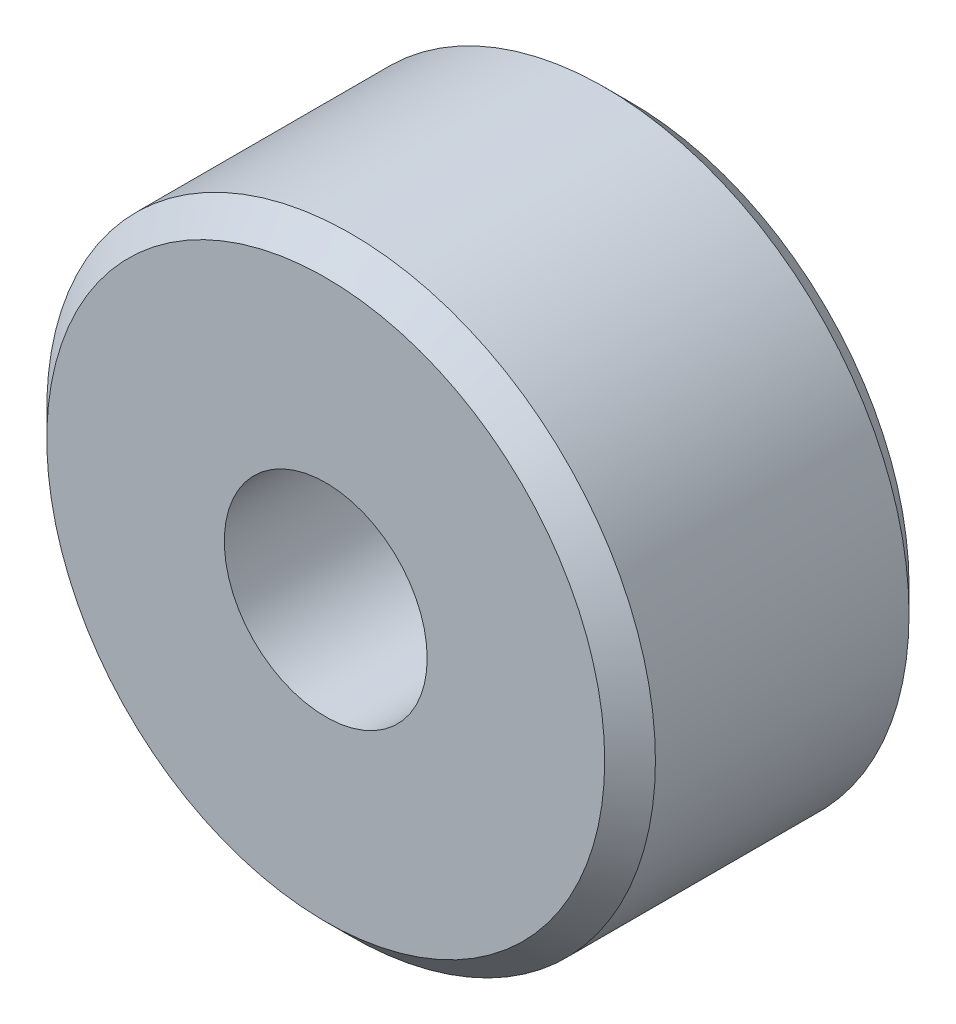
ISO-10303-21;
HEADER;
FILE_DESCRIPTION(('STEP AP214'),'2;1');
FILE_NAME('part.step','',(''),(''),'','','');
FILE_SCHEMA(('AUTOMOTIVE_DESIGN { 1 0 10303 214 1 1 1 1 }'));
ENDSEC;
DATA;
#1=APPLICATION_CONTEXT('core data for automotive mechanical design processes');
#2=APPLICATION_PROTOCOL_DEFINITION('international standard','automotive_design',2000,#1);
#3=PRODUCT_CONTEXT('',#1,'mechanical');
#4=PRODUCT('Part','Part','',(#3));
#5=PRODUCT_RELATED_PRODUCT_CATEGORY('part','',(#4));
#6=PRODUCT_DEFINITION_FORMATION('','',#4);
#7=PRODUCT_DEFINITION_CONTEXT('part definition',#1,'design');
#8=PRODUCT_DEFINITION('design','',#6,#7);
#9=PRODUCT_DEFINITION_SHAPE('','',#8);
#10=(LENGTH_UNIT() NAMED_UNIT(*) SI_UNIT(.MILLI.,.METRE.));
#11=(NAMED_UNIT(*) PLANE_ANGLE_UNIT() SI_UNIT($,.RADIAN.));
#12=(NAMED_UNIT(*) SI_UNIT($,.STERADIAN.) SOLID_ANGLE_UNIT());
#13=UNCERTAINTY_MEASURE_WITH_UNIT(LENGTH_MEASURE(1.E-05),#10,'distance_accuracy_value','');
#14=(GEOMETRIC_REPRESENTATION_CONTEXT(3) GLOBAL_UNCERTAINTY_ASSIGNED_CONTEXT((#13)) GLOBAL_UNIT_ASSIGNED_CONTEXT((#10,
#11,#12)) REPRESENTATION_CONTEXT('',''));
#15=CARTESIAN_POINT('',(0.,0.,0.));
#16=DIRECTION('',(0.,0.,1.));
#17=DIRECTION('',(1.,0.,0.));
#18=AXIS2_PLACEMENT_3D('',#15,#16,#17);
#19=CARTESIAN_POINT('',(0.,0.,3.));
#20=DIRECTION('',(0.,0.,1.));
#21=DIRECTION('',(1.,0.,0.));
#22=AXIS2_PLACEMENT_3D('',#19,#20,#21);
#23=PLANE('',#22);
#24=CARTESIAN_POINT('',(0.,0.,3.));
#25=DIRECTION('',(0.,0.,1.));
#26=DIRECTION('',(1.,0.,0.));
#27=AXIS2_PLACEMENT_3D('',#24,#25,#26);
#28=CIRCLE('',#27,2.75);
#29=CARTESIAN_POINT('',(2.75,0.,3.));
#30=VERTEX_POINT('',#29);
#31=EDGE_CURVE('E11',#30,#30,#28,.T.);
#32=ORIENTED_EDGE('',*,*,#31,.T.);
#33=EDGE_LOOP('',(#32));
#34=FACE_BOUND('',#33,.T.);
#35=CARTESIAN_POINT('',(0.,0.,3.));
#36=DIRECTION('',(0.,0.,1.));
#37=DIRECTION('',(1.,0.,0.));
#38=AXIS2_PLACEMENT_3D('',#35,#36,#37);
#39=CIRCLE('',#38,1.);
#40=CARTESIAN_POINT('',(1.,0.,3.));
#41=VERTEX_POINT('',#40);
#42=EDGE_CURVE('E61',#41,#41,#39,.T.);
#43=ORIENTED_EDGE('',*,*,#42,.F.);
#44=EDGE_LOOP('',(#43));
#45=FACE_BOUND('',#44,.T.);
#46=ADVANCED_FACE('F40',(#34,#45),#23,.T.);
#47=CARTESIAN_POINT('',(0.,0.,0.));
#48=DIRECTION('',(0.,0.,1.));
#49=DIRECTION('',(1.,0.,0.));
#50=AXIS2_PLACEMENT_3D('',#47,#48,#49);
#51=PLANE('',#50);
#52=CARTESIAN_POINT('',(0.,0.,0.));
#53=DIRECTION('',(0.,0.,1.));
#54=DIRECTION('',(1.,0.,0.));
#55=AXIS2_PLACEMENT_3D('',#52,#53,#54);
#56=CIRCLE('',#55,2.75);
#57=CARTESIAN_POINT('',(2.75,0.,0.));
#58=VERTEX_POINT('',#57);
#59=EDGE_CURVE('E48',#58,#58,#56,.F.);
#60=ORIENTED_EDGE('',*,*,#59,.T.);
#61=EDGE_LOOP('',(#60));
#62=FACE_BOUND('',#61,.T.);
#63=CARTESIAN_POINT('',(0.,0.,0.));
#64=DIRECTION('',(0.,0.,1.));
#65=DIRECTION('',(1.,0.,0.));
#66=AXIS2_PLACEMENT_3D('',#63,#64,#65);
#67=CIRCLE('',#66,1.);
#68=CARTESIAN_POINT('',(1.,0.,0.));
#69=VERTEX_POINT('',#68);
#70=EDGE_CURVE('E62',#69,#69,#67,.T.);
#71=ORIENTED_EDGE('',*,*,#70,.T.);
#72=EDGE_LOOP('',(#71));
#73=FACE_BOUND('',#72,.T.);
#74=ADVANCED_FACE('F72',(#62,#73),#51,.F.);
#75=CARTESIAN_POINT('',(0.,0.,3.));
#76=DIRECTION('',(0.,0.,-1.));
#77=DIRECTION('',(-1.,0.,0.));
#78=AXIS2_PLACEMENT_3D('',#75,#76,#77);
#79=CYLINDRICAL_SURFACE('',#78,3.);
#80=CARTESIAN_POINT('',(0.,0.,0.250000000000001));
#81=DIRECTION('',(0.,0.,1.));
#82=DIRECTION('',(1.,0.,0.));
#83=AXIS2_PLACEMENT_3D('',#80,#81,#82);
#84=CIRCLE('',#83,3.);
#85=CARTESIAN_POINT('',(3.,0.,0.250000000000001));
#86=VERTEX_POINT('',#85);
#87=EDGE_CURVE('E52',#86,#86,#84,.T.);
#88=ORIENTED_EDGE('',*,*,#87,.T.);
#89=EDGE_LOOP('',(#88));
#90=FACE_BOUND('',#89,.T.);
#91=CARTESIAN_POINT('',(0.,0.,2.75));
#92=DIRECTION('',(0.,0.,1.));
#93=DIRECTION('',(1.,0.,0.));
#94=AXIS2_PLACEMENT_3D('',#91,#92,#93);
#95=CIRCLE('',#94,3.);
#96=CARTESIAN_POINT('',(3.,0.,2.75));
#97=VERTEX_POINT('',#96);
#98=EDGE_CURVE('E56',#97,#97,#95,.F.);
#99=ORIENTED_EDGE('',*,*,#98,.T.);
#100=EDGE_LOOP('',(#99));
#101=FACE_BOUND('',#100,.T.);
#102=ADVANCED_FACE('F77',(#90,#101),#79,.T.);
#103=CARTESIAN_POINT('',(0.,0.,3.));
#104=DIRECTION('',(0.,0.,-1.));
#105=DIRECTION('',(-1.,0.,0.));
#106=AXIS2_PLACEMENT_3D('',#103,#104,#105);
#107=CYLINDRICAL_SURFACE('',#106,1.);
#108=ORIENTED_EDGE('',*,*,#42,.T.);
#109=EDGE_LOOP('',(#108));
#110=FACE_BOUND('',#109,.T.);
#111=ORIENTED_EDGE('',*,*,#70,.F.);
#112=EDGE_LOOP('',(#111));
#113=FACE_BOUND('',#112,.T.);
#114=ADVANCED_FACE('F68',(#110,#113),#107,.F.);
#115=CARTESIAN_POINT('',(0.,0.,0.250000000000001));
#116=DIRECTION('',(0.,0.,1.));
#117=DIRECTION('',(1.,0.,0.));
#118=AXIS2_PLACEMENT_3D('',#115,#116,#117);
#119=CONICAL_SURFACE('',#118,3.,0.78539816339745);
#120=ORIENTED_EDGE('',*,*,#59,.F.);
#121=EDGE_LOOP('',(#120));
#122=FACE_BOUND('',#121,.T.);
#123=ORIENTED_EDGE('',*,*,#87,.F.);
#124=EDGE_LOOP('',(#123));
#125=FACE_BOUND('',#124,.T.);
#126=ADVANCED_FACE('F84',(#122,#125),#119,.T.);
#127=CARTESIAN_POINT('',(0.,0.,3.));
#128=DIRECTION('',(0.,0.,-1.));
#129=DIRECTION('',(-1.,0.,0.));
#130=AXIS2_PLACEMENT_3D('',#127,#128,#129);
#131=CONICAL_SURFACE('',#130,2.75,0.785398163397447);
#132=ORIENTED_EDGE('',*,*,#98,.F.);
#133=EDGE_LOOP('',(#132));
#134=FACE_BOUND('',#133,.T.);
#135=ORIENTED_EDGE('',*,*,#31,.F.);
#136=EDGE_LOOP('',(#135));
#137=FACE_BOUND('',#136,.T.);
#138=ADVANCED_FACE('F43',(#134,#137),#131,.T.);
#139=CLOSED_SHELL('',(#46,#74,#102,#114,#126,#138));
#140=MANIFOLD_SOLID_BREP('B2',#139);
#141=ADVANCED_BREP_SHAPE_REPRESENTATION('',(#18,#140),#14);
#142=SHAPE_DEFINITION_REPRESENTATION(#9,#141);
ENDSEC;
END-ISO-10303-21;
